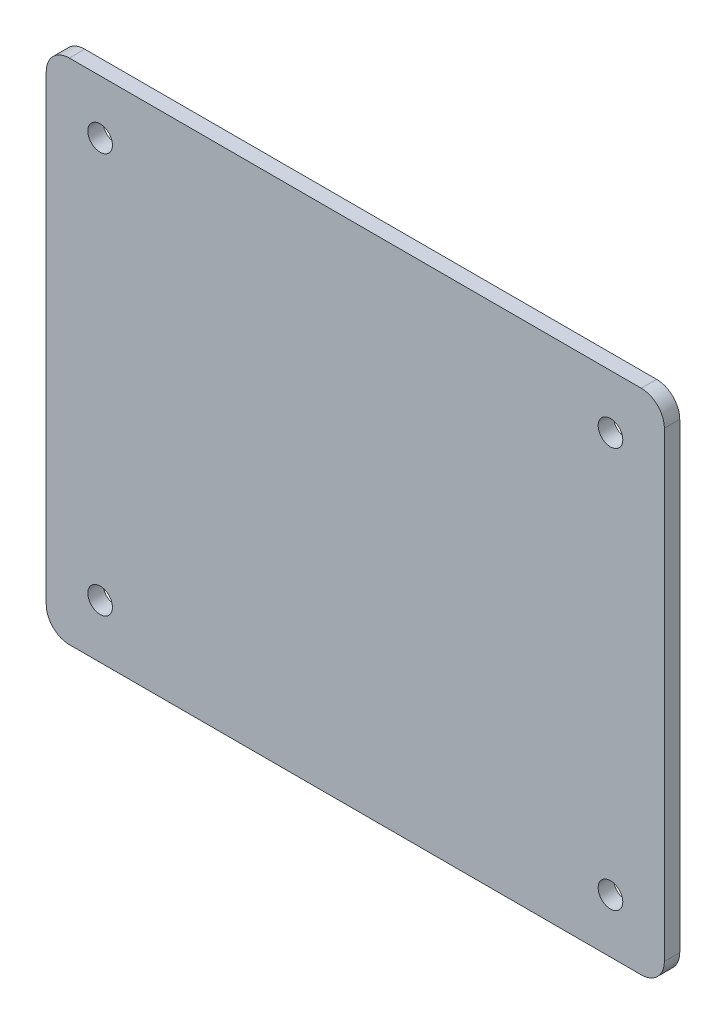
ISO-10303-21;
HEADER;
FILE_DESCRIPTION(('STEP AP214'),'2;1');
FILE_NAME('part.step','',(''),(''),'','','');
FILE_SCHEMA(('AUTOMOTIVE_DESIGN { 1 0 10303 214 1 1 1 1 }'));
ENDSEC;
DATA;
#1=APPLICATION_CONTEXT('core data for automotive mechanical design processes');
#2=APPLICATION_PROTOCOL_DEFINITION('international standard','automotive_design',2000,#1);
#3=PRODUCT_CONTEXT('',#1,'mechanical');
#4=PRODUCT('Part','Part','',(#3));
#5=PRODUCT_RELATED_PRODUCT_CATEGORY('part','',(#4));
#6=PRODUCT_DEFINITION_FORMATION('','',#4);
#7=PRODUCT_DEFINITION_CONTEXT('part definition',#1,'design');
#8=PRODUCT_DEFINITION('design','',#6,#7);
#9=PRODUCT_DEFINITION_SHAPE('','',#8);
#10=(LENGTH_UNIT() NAMED_UNIT(*) SI_UNIT(.MILLI.,.METRE.));
#11=(NAMED_UNIT(*) PLANE_ANGLE_UNIT() SI_UNIT($,.RADIAN.));
#12=(NAMED_UNIT(*) SI_UNIT($,.STERADIAN.) SOLID_ANGLE_UNIT());
#13=UNCERTAINTY_MEASURE_WITH_UNIT(LENGTH_MEASURE(1.E-05),#10,'distance_accuracy_value','');
#14=(GEOMETRIC_REPRESENTATION_CONTEXT(3) GLOBAL_UNCERTAINTY_ASSIGNED_CONTEXT((#13)) GLOBAL_UNIT_ASSIGNED_CONTEXT((#10,
#11,#12)) REPRESENTATION_CONTEXT('',''));
#15=CARTESIAN_POINT('',(0.,0.,0.));
#16=DIRECTION('',(0.,0.,1.));
#17=DIRECTION('',(1.,0.,0.));
#18=AXIS2_PLACEMENT_3D('',#15,#16,#17);
#19=CARTESIAN_POINT('',(0.,0.,2.));
#20=DIRECTION('',(1.,0.,0.));
#21=DIRECTION('',(0.,0.,-1.));
#22=AXIS2_PLACEMENT_3D('',#19,#20,#21);
#23=PLANE('',#22);
#24=DIRECTION('',(0.,-1.,0.));
#25=VECTOR('',#24,1.);
#26=CARTESIAN_POINT('',(0.,0.,0.));
#27=LINE('',#26,#25);
#28=CARTESIAN_POINT('',(0.,63.,0.));
#29=VERTEX_POINT('',#28);
#30=CARTESIAN_POINT('',(0.,3.,0.));
#31=VERTEX_POINT('',#30);
#32=EDGE_CURVE('E156',#29,#31,#27,.T.);
#33=ORIENTED_EDGE('',*,*,#32,.T.);
#34=DIRECTION('',(0.,0.,-1.));
#35=VECTOR('',#34,1.);
#36=CARTESIAN_POINT('',(0.,3.,2.));
#37=LINE('',#36,#35);
#38=CARTESIAN_POINT('',(0.,3.,2.));
#39=VERTEX_POINT('',#38);
#40=EDGE_CURVE('E11',#31,#39,#37,.F.);
#41=ORIENTED_EDGE('',*,*,#40,.T.);
#42=DIRECTION('',(0.,-1.,0.));
#43=VECTOR('',#42,1.);
#44=CARTESIAN_POINT('',(0.,0.,2.));
#45=LINE('',#44,#43);
#46=CARTESIAN_POINT('',(0.,63.,2.));
#47=VERTEX_POINT('',#46);
#48=EDGE_CURVE('E124',#47,#39,#45,.T.);
#49=ORIENTED_EDGE('',*,*,#48,.F.);
#50=DIRECTION('',(0.,0.,-1.));
#51=VECTOR('',#50,1.);
#52=CARTESIAN_POINT('',(0.,63.,2.));
#53=LINE('',#52,#51);
#54=EDGE_CURVE('E40',#47,#29,#53,.T.);
#55=ORIENTED_EDGE('',*,*,#54,.T.);
#56=EDGE_LOOP('',(#33,#41,#49,#55));
#57=FACE_BOUND('',#56,.T.);
#58=ADVANCED_FACE('F32',(#57),#23,.F.);
#59=CARTESIAN_POINT('',(0.,0.,2.));
#60=DIRECTION('',(0.,1.,0.));
#61=DIRECTION('',(0.,0.,1.));
#62=AXIS2_PLACEMENT_3D('',#59,#60,#61);
#63=PLANE('',#62);
#64=DIRECTION('',(1.,0.,0.));
#65=VECTOR('',#64,1.);
#66=CARTESIAN_POINT('',(0.,0.,0.));
#67=LINE('',#66,#65);
#68=CARTESIAN_POINT('',(3.,0.,0.));
#69=VERTEX_POINT('',#68);
#70=CARTESIAN_POINT('',(77.3,0.,0.));
#71=VERTEX_POINT('',#70);
#72=EDGE_CURVE('E129',#69,#71,#67,.T.);
#73=ORIENTED_EDGE('',*,*,#72,.T.);
#74=DIRECTION('',(0.,0.,-1.));
#75=VECTOR('',#74,1.);
#76=CARTESIAN_POINT('',(77.3,0.,2.));
#77=LINE('',#76,#75);
#78=CARTESIAN_POINT('',(77.3,0.,2.));
#79=VERTEX_POINT('',#78);
#80=EDGE_CURVE('E47',#71,#79,#77,.F.);
#81=ORIENTED_EDGE('',*,*,#80,.T.);
#82=DIRECTION('',(1.,0.,0.));
#83=VECTOR('',#82,1.);
#84=CARTESIAN_POINT('',(0.,0.,2.));
#85=LINE('',#84,#83);
#86=CARTESIAN_POINT('',(3.,0.,2.));
#87=VERTEX_POINT('',#86);
#88=EDGE_CURVE('E127',#87,#79,#85,.T.);
#89=ORIENTED_EDGE('',*,*,#88,.F.);
#90=DIRECTION('',(0.,0.,-1.));
#91=VECTOR('',#90,1.);
#92=CARTESIAN_POINT('',(3.,0.,2.));
#93=LINE('',#92,#91);
#94=EDGE_CURVE('E148',#87,#69,#93,.T.);
#95=ORIENTED_EDGE('',*,*,#94,.T.);
#96=EDGE_LOOP('',(#73,#81,#89,#95));
#97=FACE_BOUND('',#96,.T.);
#98=ADVANCED_FACE('F211',(#97),#63,.F.);
#99=CARTESIAN_POINT('',(80.3,0.,2.));
#100=DIRECTION('',(-1.,0.,0.));
#101=DIRECTION('',(0.,0.,1.));
#102=AXIS2_PLACEMENT_3D('',#99,#100,#101);
#103=PLANE('',#102);
#104=DIRECTION('',(0.,1.,0.));
#105=VECTOR('',#104,1.);
#106=CARTESIAN_POINT('',(80.3,0.,0.));
#107=LINE('',#106,#105);
#108=CARTESIAN_POINT('',(80.3,3.,0.));
#109=VERTEX_POINT('',#108);
#110=CARTESIAN_POINT('',(80.3,63.,0.));
#111=VERTEX_POINT('',#110);
#112=EDGE_CURVE('E125',#109,#111,#107,.T.);
#113=ORIENTED_EDGE('',*,*,#112,.T.);
#114=DIRECTION('',(0.,0.,-1.));
#115=VECTOR('',#114,1.);
#116=CARTESIAN_POINT('',(80.3,63.,2.));
#117=LINE('',#116,#115);
#118=CARTESIAN_POINT('',(80.3,63.,2.));
#119=VERTEX_POINT('',#118);
#120=EDGE_CURVE('E103',#111,#119,#117,.F.);
#121=ORIENTED_EDGE('',*,*,#120,.T.);
#122=DIRECTION('',(0.,1.,0.));
#123=VECTOR('',#122,1.);
#124=CARTESIAN_POINT('',(80.3,0.,2.));
#125=LINE('',#124,#123);
#126=CARTESIAN_POINT('',(80.3,3.,2.));
#127=VERTEX_POINT('',#126);
#128=EDGE_CURVE('E168',#127,#119,#125,.T.);
#129=ORIENTED_EDGE('',*,*,#128,.F.);
#130=DIRECTION('',(0.,0.,-1.));
#131=VECTOR('',#130,1.);
#132=CARTESIAN_POINT('',(80.3,3.,2.));
#133=LINE('',#132,#131);
#134=EDGE_CURVE('E108',#127,#109,#133,.T.);
#135=ORIENTED_EDGE('',*,*,#134,.T.);
#136=EDGE_LOOP('',(#113,#121,#129,#135));
#137=FACE_BOUND('',#136,.T.);
#138=ADVANCED_FACE('F208',(#137),#103,.F.);
#139=CARTESIAN_POINT('',(0.,66.,2.));
#140=DIRECTION('',(0.,-1.,0.));
#141=DIRECTION('',(0.,0.,-1.));
#142=AXIS2_PLACEMENT_3D('',#139,#140,#141);
#143=PLANE('',#142);
#144=DIRECTION('',(-1.,0.,0.));
#145=VECTOR('',#144,1.);
#146=CARTESIAN_POINT('',(0.,66.,2.));
#147=LINE('',#146,#145);
#148=CARTESIAN_POINT('',(77.3,66.,2.));
#149=VERTEX_POINT('',#148);
#150=CARTESIAN_POINT('',(3.,66.,2.));
#151=VERTEX_POINT('',#150);
#152=EDGE_CURVE('E118',#149,#151,#147,.T.);
#153=ORIENTED_EDGE('',*,*,#152,.F.);
#154=DIRECTION('',(0.,0.,-1.));
#155=VECTOR('',#154,1.);
#156=CARTESIAN_POINT('',(77.3,66.,2.));
#157=LINE('',#156,#155);
#158=CARTESIAN_POINT('',(77.3,66.,0.));
#159=VERTEX_POINT('',#158);
#160=EDGE_CURVE('E102',#149,#159,#157,.T.);
#161=ORIENTED_EDGE('',*,*,#160,.T.);
#162=DIRECTION('',(-1.,0.,0.));
#163=VECTOR('',#162,1.);
#164=CARTESIAN_POINT('',(0.,66.,0.));
#165=LINE('',#164,#163);
#166=CARTESIAN_POINT('',(3.,66.,0.));
#167=VERTEX_POINT('',#166);
#168=EDGE_CURVE('E115',#159,#167,#165,.T.);
#169=ORIENTED_EDGE('',*,*,#168,.T.);
#170=DIRECTION('',(0.,0.,-1.));
#171=VECTOR('',#170,1.);
#172=CARTESIAN_POINT('',(3.,66.,2.));
#173=LINE('',#172,#171);
#174=EDGE_CURVE('E120',#167,#151,#173,.F.);
#175=ORIENTED_EDGE('',*,*,#174,.T.);
#176=EDGE_LOOP('',(#153,#161,#169,#175));
#177=FACE_BOUND('',#176,.T.);
#178=ADVANCED_FACE('F114',(#177),#143,.F.);
#179=CARTESIAN_POINT('',(0.,0.,2.));
#180=DIRECTION('',(0.,0.,-1.));
#181=DIRECTION('',(-1.,0.,0.));
#182=AXIS2_PLACEMENT_3D('',#179,#180,#181);
#183=PLANE('',#182);
#184=CARTESIAN_POINT('',(7.,59.,2.));
#185=DIRECTION('',(0.,0.,1.));
#186=DIRECTION('',(1.,0.,0.));
#187=AXIS2_PLACEMENT_3D('',#184,#185,#186);
#188=CIRCLE('',#187,1.59999999999999);
#189=CARTESIAN_POINT('',(8.59999999999999,59.,2.));
#190=VERTEX_POINT('',#189);
#191=EDGE_CURVE('E189',#190,#190,#188,.T.);
#192=ORIENTED_EDGE('',*,*,#191,.F.);
#193=EDGE_LOOP('',(#192));
#194=FACE_BOUND('',#193,.T.);
#195=CARTESIAN_POINT('',(73.3,59.,2.));
#196=DIRECTION('',(0.,0.,1.));
#197=DIRECTION('',(1.,0.,0.));
#198=AXIS2_PLACEMENT_3D('',#195,#196,#197);
#199=CIRCLE('',#198,1.59999999999999);
#200=CARTESIAN_POINT('',(74.9,59.,2.));
#201=VERTEX_POINT('',#200);
#202=EDGE_CURVE('E183',#201,#201,#199,.T.);
#203=ORIENTED_EDGE('',*,*,#202,.F.);
#204=EDGE_LOOP('',(#203));
#205=FACE_BOUND('',#204,.T.);
#206=CARTESIAN_POINT('',(73.3,7.,2.));
#207=DIRECTION('',(0.,0.,1.));
#208=DIRECTION('',(1.,0.,0.));
#209=AXIS2_PLACEMENT_3D('',#206,#207,#208);
#210=CIRCLE('',#209,1.59999999999999);
#211=CARTESIAN_POINT('',(74.9,7.,2.));
#212=VERTEX_POINT('',#211);
#213=EDGE_CURVE('E177',#212,#212,#210,.T.);
#214=ORIENTED_EDGE('',*,*,#213,.F.);
#215=EDGE_LOOP('',(#214));
#216=FACE_BOUND('',#215,.T.);
#217=CARTESIAN_POINT('',(7.00000000000001,7.,2.));
#218=DIRECTION('',(0.,0.,1.));
#219=DIRECTION('',(1.,0.,0.));
#220=AXIS2_PLACEMENT_3D('',#217,#218,#219);
#221=CIRCLE('',#220,1.59999999999999);
#222=CARTESIAN_POINT('',(8.59999999999999,7.,2.));
#223=VERTEX_POINT('',#222);
#224=EDGE_CURVE('E164',#223,#223,#221,.T.);
#225=ORIENTED_EDGE('',*,*,#224,.F.);
#226=EDGE_LOOP('',(#225));
#227=FACE_BOUND('',#226,.T.);
#228=ORIENTED_EDGE('',*,*,#128,.T.);
#229=CARTESIAN_POINT('',(77.3,63.,2.));
#230=DIRECTION('',(0.,0.,-1.));
#231=DIRECTION('',(-1.,0.,0.));
#232=AXIS2_PLACEMENT_3D('',#229,#230,#231);
#233=CIRCLE('',#232,3.);
#234=EDGE_CURVE('E146',#119,#149,#233,.F.);
#235=ORIENTED_EDGE('',*,*,#234,.T.);
#236=ORIENTED_EDGE('',*,*,#152,.T.);
#237=CARTESIAN_POINT('',(3.,63.,2.));
#238=DIRECTION('',(0.,0.,-1.));
#239=DIRECTION('',(-1.,0.,0.));
#240=AXIS2_PLACEMENT_3D('',#237,#238,#239);
#241=CIRCLE('',#240,3.);
#242=EDGE_CURVE('E141',#151,#47,#241,.F.);
#243=ORIENTED_EDGE('',*,*,#242,.T.);
#244=ORIENTED_EDGE('',*,*,#48,.T.);
#245=CARTESIAN_POINT('',(3.,3.,2.));
#246=DIRECTION('',(0.,0.,-1.));
#247=DIRECTION('',(-1.,0.,0.));
#248=AXIS2_PLACEMENT_3D('',#245,#246,#247);
#249=CIRCLE('',#248,3.);
#250=EDGE_CURVE('E54',#39,#87,#249,.F.);
#251=ORIENTED_EDGE('',*,*,#250,.T.);
#252=ORIENTED_EDGE('',*,*,#88,.T.);
#253=CARTESIAN_POINT('',(77.3,3.,2.));
#254=DIRECTION('',(0.,0.,-1.));
#255=DIRECTION('',(-1.,0.,0.));
#256=AXIS2_PLACEMENT_3D('',#253,#254,#255);
#257=CIRCLE('',#256,3.);
#258=EDGE_CURVE('E144',#79,#127,#257,.F.);
#259=ORIENTED_EDGE('',*,*,#258,.T.);
#260=EDGE_LOOP('',(#228,#235,#236,#243,#244,#251,#252,#259));
#261=FACE_BOUND('',#260,.T.);
#262=ADVANCED_FACE('F195',(#194,#205,#216,#227,#261),#183,.F.);
#263=CARTESIAN_POINT('',(0.,0.,0.));
#264=DIRECTION('',(0.,0.,-1.));
#265=DIRECTION('',(-1.,0.,0.));
#266=AXIS2_PLACEMENT_3D('',#263,#264,#265);
#267=PLANE('',#266);
#268=CARTESIAN_POINT('',(7.,59.,0.));
#269=DIRECTION('',(0.,0.,1.));
#270=DIRECTION('',(1.,0.,0.));
#271=AXIS2_PLACEMENT_3D('',#268,#269,#270);
#272=CIRCLE('',#271,1.6);
#273=CARTESIAN_POINT('',(8.6,59.,0.));
#274=VERTEX_POINT('',#273);
#275=EDGE_CURVE('E186',#274,#274,#272,.T.);
#276=ORIENTED_EDGE('',*,*,#275,.T.);
#277=EDGE_LOOP('',(#276));
#278=FACE_BOUND('',#277,.T.);
#279=CARTESIAN_POINT('',(73.3,59.,0.));
#280=DIRECTION('',(0.,0.,1.));
#281=DIRECTION('',(1.,0.,0.));
#282=AXIS2_PLACEMENT_3D('',#279,#280,#281);
#283=CIRCLE('',#282,1.6);
#284=CARTESIAN_POINT('',(74.9,59.,0.));
#285=VERTEX_POINT('',#284);
#286=EDGE_CURVE('E180',#285,#285,#283,.T.);
#287=ORIENTED_EDGE('',*,*,#286,.T.);
#288=EDGE_LOOP('',(#287));
#289=FACE_BOUND('',#288,.T.);
#290=CARTESIAN_POINT('',(73.3,7.,0.));
#291=DIRECTION('',(0.,0.,1.));
#292=DIRECTION('',(1.,0.,0.));
#293=AXIS2_PLACEMENT_3D('',#290,#291,#292);
#294=CIRCLE('',#293,1.6);
#295=CARTESIAN_POINT('',(74.9,7.,0.));
#296=VERTEX_POINT('',#295);
#297=EDGE_CURVE('E174',#296,#296,#294,.T.);
#298=ORIENTED_EDGE('',*,*,#297,.T.);
#299=EDGE_LOOP('',(#298));
#300=FACE_BOUND('',#299,.T.);
#301=CARTESIAN_POINT('',(7.00000000000001,7.,0.));
#302=DIRECTION('',(0.,0.,1.));
#303=DIRECTION('',(1.,0.,0.));
#304=AXIS2_PLACEMENT_3D('',#301,#302,#303);
#305=CIRCLE('',#304,1.6);
#306=CARTESIAN_POINT('',(8.6,7.,0.));
#307=VERTEX_POINT('',#306);
#308=EDGE_CURVE('E161',#307,#307,#305,.T.);
#309=ORIENTED_EDGE('',*,*,#308,.T.);
#310=EDGE_LOOP('',(#309));
#311=FACE_BOUND('',#310,.T.);
#312=ORIENTED_EDGE('',*,*,#168,.F.);
#313=CARTESIAN_POINT('',(77.3,63.,0.));
#314=DIRECTION('',(0.,0.,-1.));
#315=DIRECTION('',(-1.,0.,0.));
#316=AXIS2_PLACEMENT_3D('',#313,#314,#315);
#317=CIRCLE('',#316,3.);
#318=EDGE_CURVE('E98',#159,#111,#317,.T.);
#319=ORIENTED_EDGE('',*,*,#318,.T.);
#320=ORIENTED_EDGE('',*,*,#112,.F.);
#321=CARTESIAN_POINT('',(77.3,3.,0.));
#322=DIRECTION('',(0.,0.,-1.));
#323=DIRECTION('',(-1.,0.,0.));
#324=AXIS2_PLACEMENT_3D('',#321,#322,#323);
#325=CIRCLE('',#324,3.);
#326=EDGE_CURVE('E109',#109,#71,#325,.T.);
#327=ORIENTED_EDGE('',*,*,#326,.T.);
#328=ORIENTED_EDGE('',*,*,#72,.F.);
#329=CARTESIAN_POINT('',(3.,3.,0.));
#330=DIRECTION('',(0.,0.,-1.));
#331=DIRECTION('',(-1.,0.,0.));
#332=AXIS2_PLACEMENT_3D('',#329,#330,#331);
#333=CIRCLE('',#332,3.);
#334=EDGE_CURVE('E135',#69,#31,#333,.T.);
#335=ORIENTED_EDGE('',*,*,#334,.T.);
#336=ORIENTED_EDGE('',*,*,#32,.F.);
#337=CARTESIAN_POINT('',(3.,63.,0.));
#338=DIRECTION('',(0.,0.,-1.));
#339=DIRECTION('',(-1.,0.,0.));
#340=AXIS2_PLACEMENT_3D('',#337,#338,#339);
#341=CIRCLE('',#340,3.);
#342=EDGE_CURVE('E119',#29,#167,#341,.T.);
#343=ORIENTED_EDGE('',*,*,#342,.T.);
#344=EDGE_LOOP('',(#312,#319,#320,#327,#328,#335,#336,#343));
#345=FACE_BOUND('',#344,.T.);
#346=ADVANCED_FACE('F122',(#278,#289,#300,#311,#345),#267,.T.);
#347=CARTESIAN_POINT('',(7.00000000000001,7.,2.));
#348=DIRECTION('',(0.,0.,1.));
#349=DIRECTION('',(1.,0.,0.));
#350=AXIS2_PLACEMENT_3D('',#347,#348,#349);
#351=CYLINDRICAL_SURFACE('',#350,1.59999999999999);
#352=ORIENTED_EDGE('',*,*,#308,.F.);
#353=EDGE_LOOP('',(#352));
#354=FACE_BOUND('',#353,.T.);
#355=ORIENTED_EDGE('',*,*,#224,.T.);
#356=EDGE_LOOP('',(#355));
#357=FACE_BOUND('',#356,.T.);
#358=ADVANCED_FACE('F277',(#354,#357),#351,.F.);
#359=CARTESIAN_POINT('',(73.3,7.,2.));
#360=DIRECTION('',(0.,0.,1.));
#361=DIRECTION('',(1.,0.,0.));
#362=AXIS2_PLACEMENT_3D('',#359,#360,#361);
#363=CYLINDRICAL_SURFACE('',#362,1.6);
#364=ORIENTED_EDGE('',*,*,#297,.F.);
#365=EDGE_LOOP('',(#364));
#366=FACE_BOUND('',#365,.T.);
#367=ORIENTED_EDGE('',*,*,#213,.T.);
#368=EDGE_LOOP('',(#367));
#369=FACE_BOUND('',#368,.T.);
#370=ADVANCED_FACE('F268',(#366,#369),#363,.F.);
#371=CARTESIAN_POINT('',(73.3,59.,2.));
#372=DIRECTION('',(0.,0.,1.));
#373=DIRECTION('',(1.,0.,0.));
#374=AXIS2_PLACEMENT_3D('',#371,#372,#373);
#375=CYLINDRICAL_SURFACE('',#374,1.6);
#376=ORIENTED_EDGE('',*,*,#286,.F.);
#377=EDGE_LOOP('',(#376));
#378=FACE_BOUND('',#377,.T.);
#379=ORIENTED_EDGE('',*,*,#202,.T.);
#380=EDGE_LOOP('',(#379));
#381=FACE_BOUND('',#380,.T.);
#382=ADVANCED_FACE('F259',(#378,#381),#375,.F.);
#383=CARTESIAN_POINT('',(7.,59.,2.));
#384=DIRECTION('',(0.,0.,1.));
#385=DIRECTION('',(1.,0.,0.));
#386=AXIS2_PLACEMENT_3D('',#383,#384,#385);
#387=CYLINDRICAL_SURFACE('',#386,1.59999999999999);
#388=ORIENTED_EDGE('',*,*,#275,.F.);
#389=EDGE_LOOP('',(#388));
#390=FACE_BOUND('',#389,.T.);
#391=ORIENTED_EDGE('',*,*,#191,.T.);
#392=EDGE_LOOP('',(#391));
#393=FACE_BOUND('',#392,.T.);
#394=ADVANCED_FACE('F193',(#390,#393),#387,.F.);
#395=CARTESIAN_POINT('',(77.3,63.,2.));
#396=DIRECTION('',(0.,0.,-1.));
#397=DIRECTION('',(-1.,0.,0.));
#398=AXIS2_PLACEMENT_3D('',#395,#396,#397);
#399=CYLINDRICAL_SURFACE('',#398,3.);
#400=ORIENTED_EDGE('',*,*,#234,.F.);
#401=ORIENTED_EDGE('',*,*,#120,.F.);
#402=ORIENTED_EDGE('',*,*,#318,.F.);
#403=ORIENTED_EDGE('',*,*,#160,.F.);
#404=EDGE_LOOP('',(#400,#401,#402,#403));
#405=FACE_BOUND('',#404,.T.);
#406=ADVANCED_FACE('F101',(#405),#399,.T.);
#407=CARTESIAN_POINT('',(77.3,3.,2.));
#408=DIRECTION('',(0.,0.,-1.));
#409=DIRECTION('',(-1.,0.,0.));
#410=AXIS2_PLACEMENT_3D('',#407,#408,#409);
#411=CYLINDRICAL_SURFACE('',#410,3.);
#412=ORIENTED_EDGE('',*,*,#258,.F.);
#413=ORIENTED_EDGE('',*,*,#80,.F.);
#414=ORIENTED_EDGE('',*,*,#326,.F.);
#415=ORIENTED_EDGE('',*,*,#134,.F.);
#416=EDGE_LOOP('',(#412,#413,#414,#415));
#417=FACE_BOUND('',#416,.T.);
#418=ADVANCED_FACE('F210',(#417),#411,.T.);
#419=CARTESIAN_POINT('',(3.,3.,2.));
#420=DIRECTION('',(0.,0.,-1.));
#421=DIRECTION('',(-1.,0.,0.));
#422=AXIS2_PLACEMENT_3D('',#419,#420,#421);
#423=CYLINDRICAL_SURFACE('',#422,3.);
#424=ORIENTED_EDGE('',*,*,#250,.F.);
#425=ORIENTED_EDGE('',*,*,#40,.F.);
#426=ORIENTED_EDGE('',*,*,#334,.F.);
#427=ORIENTED_EDGE('',*,*,#94,.F.);
#428=EDGE_LOOP('',(#424,#425,#426,#427));
#429=FACE_BOUND('',#428,.T.);
#430=ADVANCED_FACE('F214',(#429),#423,.T.);
#431=CARTESIAN_POINT('',(3.,63.,2.));
#432=DIRECTION('',(0.,0.,-1.));
#433=DIRECTION('',(-1.,0.,0.));
#434=AXIS2_PLACEMENT_3D('',#431,#432,#433);
#435=CYLINDRICAL_SURFACE('',#434,3.);
#436=ORIENTED_EDGE('',*,*,#242,.F.);
#437=ORIENTED_EDGE('',*,*,#174,.F.);
#438=ORIENTED_EDGE('',*,*,#342,.F.);
#439=ORIENTED_EDGE('',*,*,#54,.F.);
#440=EDGE_LOOP('',(#436,#437,#438,#439));
#441=FACE_BOUND('',#440,.T.);
#442=ADVANCED_FACE('F34',(#441),#435,.T.);
#443=CLOSED_SHELL('',(#58,#98,#138,#178,#262,#346,#358,#370,#382,#394,#406,#418,#430,#442));
#444=MANIFOLD_SOLID_BREP('B2',#443);
#445=ADVANCED_BREP_SHAPE_REPRESENTATION('',(#18,#444),#14);
#446=SHAPE_DEFINITION_REPRESENTATION(#9,#445);
ENDSEC;
END-ISO-10303-21;
